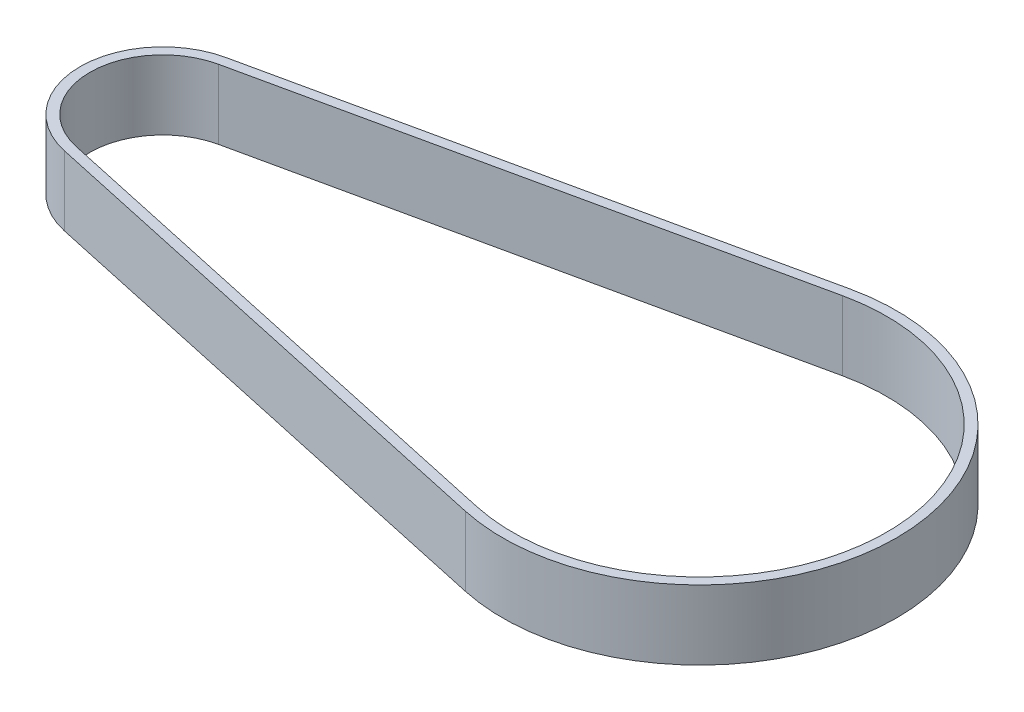
ISO-10303-21;
HEADER;
FILE_DESCRIPTION(('STEP AP214'),'2;1');
FILE_NAME('part.step','',(''),(''),'','','');
FILE_SCHEMA(('AUTOMOTIVE_DESIGN { 1 0 10303 214 1 1 1 1 }'));
ENDSEC;
DATA;
#1=APPLICATION_CONTEXT('core data for automotive mechanical design processes');
#2=APPLICATION_PROTOCOL_DEFINITION('international standard','automotive_design',2000,#1);
#3=PRODUCT_CONTEXT('',#1,'mechanical');
#4=PRODUCT('Part','Part','',(#3));
#5=PRODUCT_RELATED_PRODUCT_CATEGORY('part','',(#4));
#6=PRODUCT_DEFINITION_FORMATION('','',#4);
#7=PRODUCT_DEFINITION_CONTEXT('part definition',#1,'design');
#8=PRODUCT_DEFINITION('design','',#6,#7);
#9=PRODUCT_DEFINITION_SHAPE('','',#8);
#10=(LENGTH_UNIT() NAMED_UNIT(*) SI_UNIT(.MILLI.,.METRE.));
#11=(NAMED_UNIT(*) PLANE_ANGLE_UNIT() SI_UNIT($,.RADIAN.));
#12=(NAMED_UNIT(*) SI_UNIT($,.STERADIAN.) SOLID_ANGLE_UNIT());
#13=UNCERTAINTY_MEASURE_WITH_UNIT(LENGTH_MEASURE(1.E-05),#10,'distance_accuracy_value','');
#14=(GEOMETRIC_REPRESENTATION_CONTEXT(3) GLOBAL_UNCERTAINTY_ASSIGNED_CONTEXT((#13)) GLOBAL_UNIT_ASSIGNED_CONTEXT((#10,
#11,#12)) REPRESENTATION_CONTEXT('',''));
#15=CARTESIAN_POINT('',(0.,0.,0.));
#16=DIRECTION('',(0.,0.,1.));
#17=DIRECTION('',(1.,0.,0.));
#18=AXIS2_PLACEMENT_3D('',#15,#16,#17);
#19=CARTESIAN_POINT('',(-71.8766789781022,9.,10.473355567288));
#20=DIRECTION('',(0.212773722627737,0.,-0.977101500847857));
#21=DIRECTION('',(-0.977101500847857,0.,-0.212773722627737));
#22=AXIS2_PLACEMENT_3D('',#19,#20,#21);
#23=PLANE('',#22);
#24=DIRECTION('',(0.,-1.,0.));
#25=VECTOR('',#24,1.);
#26=CARTESIAN_POINT('',(-5.43147481751825,9.,24.9424700121432));
#27=LINE('',#26,#25);
#28=CARTESIAN_POINT('',(-5.43147481751825,9.,24.9424700121432));
#29=VERTEX_POINT('',#28);
#30=CARTESIAN_POINT('',(-5.43147481751825,0.,24.9424700121432));
#31=VERTEX_POINT('',#30);
#32=EDGE_CURVE('E92',#29,#31,#27,.T.);
#33=ORIENTED_EDGE('',*,*,#32,.F.);
#34=DIRECTION('',(0.977101500847857,0.,0.212773722627737));
#35=VECTOR('',#34,1.);
#36=CARTESIAN_POINT('',(-71.8766789781022,9.,10.473355567288));
#37=LINE('',#36,#35);
#38=CARTESIAN_POINT('',(-71.8766789781022,9.,10.473355567288));
#39=VERTEX_POINT('',#38);
#40=EDGE_CURVE('E91',#39,#29,#37,.T.);
#41=ORIENTED_EDGE('',*,*,#40,.F.);
#42=DIRECTION('',(0.,-1.,0.));
#43=VECTOR('',#42,1.);
#44=CARTESIAN_POINT('',(-71.8766789781022,9.,10.473355567288));
#45=LINE('',#44,#43);
#46=CARTESIAN_POINT('',(-71.8766789781022,0.,10.473355567288));
#47=VERTEX_POINT('',#46);
#48=EDGE_CURVE('E79',#47,#39,#45,.F.);
#49=ORIENTED_EDGE('',*,*,#48,.F.);
#50=DIRECTION('',(0.977101500847857,0.,0.212773722627737));
#51=VECTOR('',#50,1.);
#52=CARTESIAN_POINT('',(-71.8766789781022,0.,10.473355567288));
#53=LINE('',#52,#51);
#54=EDGE_CURVE('E107',#47,#31,#53,.T.);
#55=ORIENTED_EDGE('',*,*,#54,.T.);
#56=EDGE_LOOP('',(#33,#41,#49,#55));
#57=FACE_BOUND('',#56,.T.);
#58=ADVANCED_FACE('F17',(#57),#23,.F.);
#59=CARTESIAN_POINT('',(-69.596,9.,0.));
#60=DIRECTION('',(0.,-1.,0.));
#61=DIRECTION('',(0.,0.,-1.));
#62=AXIS2_PLACEMENT_3D('',#59,#60,#61);
#63=CYLINDRICAL_SURFACE('',#62,10.7188);
#64=CARTESIAN_POINT('',(-69.596,9.,0.));
#65=DIRECTION('',(0.,-1.,0.));
#66=DIRECTION('',(0.,0.,-1.));
#67=AXIS2_PLACEMENT_3D('',#64,#65,#66);
#68=CIRCLE('',#67,10.7188);
#69=CARTESIAN_POINT('',(-71.8766789781022,9.,-10.473355567288));
#70=VERTEX_POINT('',#69);
#71=EDGE_CURVE('E20',#70,#39,#68,.F.);
#72=ORIENTED_EDGE('',*,*,#71,.F.);
#73=DIRECTION('',(0.,1.,0.));
#74=VECTOR('',#73,1.);
#75=CARTESIAN_POINT('',(-71.8766789781022,9.,-10.473355567288));
#76=LINE('',#75,#74);
#77=CARTESIAN_POINT('',(-71.8766789781022,0.,-10.473355567288));
#78=VERTEX_POINT('',#77);
#79=EDGE_CURVE('E99',#70,#78,#76,.F.);
#80=ORIENTED_EDGE('',*,*,#79,.T.);
#81=CARTESIAN_POINT('',(-69.596,0.,0.));
#82=DIRECTION('',(0.,-1.,0.));
#83=DIRECTION('',(0.,0.,-1.));
#84=AXIS2_PLACEMENT_3D('',#81,#82,#83);
#85=CIRCLE('',#84,10.7188);
#86=EDGE_CURVE('E83',#78,#47,#85,.F.);
#87=ORIENTED_EDGE('',*,*,#86,.T.);
#88=ORIENTED_EDGE('',*,*,#48,.T.);
#89=EDGE_LOOP('',(#72,#80,#87,#88));
#90=FACE_BOUND('',#89,.T.);
#91=ADVANCED_FACE('F81',(#90),#63,.T.);
#92=CARTESIAN_POINT('',(-71.606456350365,9.,-9.23243666121123));
#93=DIRECTION('',(0.212773722627737,0.,0.977101500847857));
#94=DIRECTION('',(0.977101500847857,0.,-0.212773722627737));
#95=AXIS2_PLACEMENT_3D('',#92,#93,#94);
#96=PLANE('',#95);
#97=DIRECTION('',(0.977101500847857,0.,-0.212773722627737));
#98=VECTOR('',#97,1.);
#99=CARTESIAN_POINT('',(-71.606456350365,9.,-9.23243666121123));
#100=LINE('',#99,#98);
#101=CARTESIAN_POINT('',(-71.606456350365,9.,-9.23243666121123));
#102=VERTEX_POINT('',#101);
#103=CARTESIAN_POINT('',(-5.16125218978103,9.,-23.7015511060665));
#104=VERTEX_POINT('',#103);
#105=EDGE_CURVE('E122',#102,#104,#100,.T.);
#106=ORIENTED_EDGE('',*,*,#105,.F.);
#107=DIRECTION('',(0.,-1.,0.));
#108=VECTOR('',#107,1.);
#109=CARTESIAN_POINT('',(-71.606456350365,9.,-9.23243666121123));
#110=LINE('',#109,#108);
#111=CARTESIAN_POINT('',(-71.606456350365,0.,-9.23243666121123));
#112=VERTEX_POINT('',#111);
#113=EDGE_CURVE('E100',#102,#112,#110,.T.);
#114=ORIENTED_EDGE('',*,*,#113,.T.);
#115=DIRECTION('',(0.977101500847857,0.,-0.212773722627737));
#116=VECTOR('',#115,1.);
#117=CARTESIAN_POINT('',(-71.606456350365,0.,-9.23243666121123));
#118=LINE('',#117,#116);
#119=CARTESIAN_POINT('',(-5.16125218978103,0.,-23.7015511060665));
#120=VERTEX_POINT('',#119);
#121=EDGE_CURVE('E118',#112,#120,#118,.T.);
#122=ORIENTED_EDGE('',*,*,#121,.T.);
#123=DIRECTION('',(0.,-1.,0.));
#124=VECTOR('',#123,1.);
#125=CARTESIAN_POINT('',(-5.16125218978104,9.,-23.7015511060665));
#126=LINE('',#125,#124);
#127=EDGE_CURVE('E87',#120,#104,#126,.F.);
#128=ORIENTED_EDGE('',*,*,#127,.T.);
#129=EDGE_LOOP('',(#106,#114,#122,#128));
#130=FACE_BOUND('',#129,.T.);
#131=ADVANCED_FACE('F145',(#130),#96,.T.);
#132=CARTESIAN_POINT('',(0.,9.,0.));
#133=DIRECTION('',(0.,-1.,0.));
#134=DIRECTION('',(0.,0.,-1.));
#135=AXIS2_PLACEMENT_3D('',#132,#133,#134);
#136=CYLINDRICAL_SURFACE('',#135,24.257);
#137=CARTESIAN_POINT('',(0.,9.,0.));
#138=DIRECTION('',(0.,-1.,0.));
#139=DIRECTION('',(0.,0.,-1.));
#140=AXIS2_PLACEMENT_3D('',#137,#138,#139);
#141=CIRCLE('',#140,24.257);
#142=CARTESIAN_POINT('',(-5.16125218978103,9.,23.7015511060665));
#143=VERTEX_POINT('',#142);
#144=EDGE_CURVE('E108',#104,#143,#141,.T.);
#145=ORIENTED_EDGE('',*,*,#144,.F.);
#146=ORIENTED_EDGE('',*,*,#127,.F.);
#147=CARTESIAN_POINT('',(0.,0.,0.));
#148=DIRECTION('',(0.,-1.,0.));
#149=DIRECTION('',(0.,0.,-1.));
#150=AXIS2_PLACEMENT_3D('',#147,#148,#149);
#151=CIRCLE('',#150,24.257);
#152=CARTESIAN_POINT('',(-5.16125218978103,0.,23.7015511060665));
#153=VERTEX_POINT('',#152);
#154=EDGE_CURVE('E116',#120,#153,#151,.T.);
#155=ORIENTED_EDGE('',*,*,#154,.T.);
#156=DIRECTION('',(0.,1.,0.));
#157=VECTOR('',#156,1.);
#158=CARTESIAN_POINT('',(-5.16125218978103,9.,23.7015511060665));
#159=LINE('',#158,#157);
#160=EDGE_CURVE('E138',#143,#153,#159,.F.);
#161=ORIENTED_EDGE('',*,*,#160,.F.);
#162=EDGE_LOOP('',(#145,#146,#155,#161));
#163=FACE_BOUND('',#162,.T.);
#164=ADVANCED_FACE('F148',(#163),#136,.F.);
#165=CARTESIAN_POINT('',(-71.606456350365,9.,9.23243666121123));
#166=DIRECTION('',(0.212773722627737,0.,-0.977101500847857));
#167=DIRECTION('',(-0.977101500847857,0.,-0.212773722627737));
#168=AXIS2_PLACEMENT_3D('',#165,#166,#167);
#169=PLANE('',#168);
#170=DIRECTION('',(-0.977101500847857,0.,-0.212773722627737));
#171=VECTOR('',#170,1.);
#172=CARTESIAN_POINT('',(-5.16125218978103,9.,23.7015511060665));
#173=LINE('',#172,#171);
#174=CARTESIAN_POINT('',(-71.606456350365,9.,9.23243666121123));
#175=VERTEX_POINT('',#174);
#176=EDGE_CURVE('E125',#143,#175,#173,.T.);
#177=ORIENTED_EDGE('',*,*,#176,.F.);
#178=ORIENTED_EDGE('',*,*,#160,.T.);
#179=DIRECTION('',(-0.977101500847857,0.,-0.212773722627737));
#180=VECTOR('',#179,1.);
#181=CARTESIAN_POINT('',(-5.16125218978103,0.,23.7015511060665));
#182=LINE('',#181,#180);
#183=CARTESIAN_POINT('',(-71.606456350365,0.,9.23243666121123));
#184=VERTEX_POINT('',#183);
#185=EDGE_CURVE('E115',#153,#184,#182,.T.);
#186=ORIENTED_EDGE('',*,*,#185,.T.);
#187=DIRECTION('',(0.,-1.,0.));
#188=VECTOR('',#187,1.);
#189=CARTESIAN_POINT('',(-71.606456350365,9.,9.23243666121123));
#190=LINE('',#189,#188);
#191=EDGE_CURVE('E103',#184,#175,#190,.F.);
#192=ORIENTED_EDGE('',*,*,#191,.T.);
#193=EDGE_LOOP('',(#177,#178,#186,#192));
#194=FACE_BOUND('',#193,.T.);
#195=ADVANCED_FACE('F151',(#194),#169,.T.);
#196=CARTESIAN_POINT('',(-69.596,9.,0.));
#197=DIRECTION('',(0.,-1.,0.));
#198=DIRECTION('',(0.,0.,-1.));
#199=AXIS2_PLACEMENT_3D('',#196,#197,#198);
#200=CYLINDRICAL_SURFACE('',#199,9.4488);
#201=ORIENTED_EDGE('',*,*,#113,.F.);
#202=CARTESIAN_POINT('',(-69.596,9.,0.));
#203=DIRECTION('',(0.,-1.,0.));
#204=DIRECTION('',(0.,0.,-1.));
#205=AXIS2_PLACEMENT_3D('',#202,#203,#204);
#206=CIRCLE('',#205,9.4488);
#207=EDGE_CURVE('E123',#175,#102,#206,.T.);
#208=ORIENTED_EDGE('',*,*,#207,.F.);
#209=ORIENTED_EDGE('',*,*,#191,.F.);
#210=CARTESIAN_POINT('',(-69.596,0.,0.));
#211=DIRECTION('',(0.,-1.,0.));
#212=DIRECTION('',(0.,0.,-1.));
#213=AXIS2_PLACEMENT_3D('',#210,#211,#212);
#214=CIRCLE('',#213,9.4488);
#215=EDGE_CURVE('E112',#184,#112,#214,.T.);
#216=ORIENTED_EDGE('',*,*,#215,.T.);
#217=EDGE_LOOP('',(#201,#208,#209,#216));
#218=FACE_BOUND('',#217,.T.);
#219=ADVANCED_FACE('F155',(#218),#200,.F.);
#220=CARTESIAN_POINT('',(-71.8766789781022,9.,-10.473355567288));
#221=DIRECTION('',(0.212773722627737,0.,0.977101500847857));
#222=DIRECTION('',(0.977101500847857,0.,-0.212773722627737));
#223=AXIS2_PLACEMENT_3D('',#220,#221,#222);
#224=PLANE('',#223);
#225=ORIENTED_EDGE('',*,*,#79,.F.);
#226=DIRECTION('',(-0.977101500847857,0.,0.212773722627737));
#227=VECTOR('',#226,1.);
#228=CARTESIAN_POINT('',(-5.43147481751823,9.,-24.9424700121433));
#229=LINE('',#228,#227);
#230=CARTESIAN_POINT('',(-5.43147481751824,9.,-24.9424700121432));
#231=VERTEX_POINT('',#230);
#232=EDGE_CURVE('E94',#231,#70,#229,.T.);
#233=ORIENTED_EDGE('',*,*,#232,.F.);
#234=DIRECTION('',(0.,-1.,0.));
#235=VECTOR('',#234,1.);
#236=CARTESIAN_POINT('',(-5.43147481751824,9.,-24.9424700121433));
#237=LINE('',#236,#235);
#238=CARTESIAN_POINT('',(-5.43147481751824,0.,-24.9424700121432));
#239=VERTEX_POINT('',#238);
#240=EDGE_CURVE('E111',#239,#231,#237,.F.);
#241=ORIENTED_EDGE('',*,*,#240,.F.);
#242=DIRECTION('',(-0.977101500847857,0.,0.212773722627737));
#243=VECTOR('',#242,1.);
#244=CARTESIAN_POINT('',(-5.43147481751823,0.,-24.9424700121433));
#245=LINE('',#244,#243);
#246=EDGE_CURVE('E120',#239,#78,#245,.T.);
#247=ORIENTED_EDGE('',*,*,#246,.T.);
#248=EDGE_LOOP('',(#225,#233,#241,#247));
#249=FACE_BOUND('',#248,.T.);
#250=ADVANCED_FACE('F165',(#249),#224,.F.);
#251=CARTESIAN_POINT('',(-69.596,9.,0.));
#252=DIRECTION('',(0.,1.,0.));
#253=DIRECTION('',(0.,0.,1.));
#254=AXIS2_PLACEMENT_3D('',#251,#252,#253);
#255=PLANE('',#254);
#256=ORIENTED_EDGE('',*,*,#105,.T.);
#257=ORIENTED_EDGE('',*,*,#144,.T.);
#258=ORIENTED_EDGE('',*,*,#176,.T.);
#259=ORIENTED_EDGE('',*,*,#207,.T.);
#260=EDGE_LOOP('',(#256,#257,#258,#259));
#261=FACE_BOUND('',#260,.T.);
#262=CARTESIAN_POINT('',(0.,9.,0.));
#263=DIRECTION('',(0.,-1.,0.));
#264=DIRECTION('',(0.,0.,-1.));
#265=AXIS2_PLACEMENT_3D('',#262,#263,#264);
#266=CIRCLE('',#265,25.527);
#267=EDGE_CURVE('E26',#231,#29,#266,.T.);
#268=ORIENTED_EDGE('',*,*,#267,.F.);
#269=ORIENTED_EDGE('',*,*,#232,.T.);
#270=ORIENTED_EDGE('',*,*,#71,.T.);
#271=ORIENTED_EDGE('',*,*,#40,.T.);
#272=EDGE_LOOP('',(#268,#269,#270,#271));
#273=FACE_BOUND('',#272,.T.);
#274=ADVANCED_FACE('F97',(#261,#273),#255,.T.);
#275=CARTESIAN_POINT('',(-69.596,0.,0.));
#276=DIRECTION('',(0.,1.,0.));
#277=DIRECTION('',(0.,0.,1.));
#278=AXIS2_PLACEMENT_3D('',#275,#276,#277);
#279=PLANE('',#278);
#280=ORIENTED_EDGE('',*,*,#185,.F.);
#281=ORIENTED_EDGE('',*,*,#154,.F.);
#282=ORIENTED_EDGE('',*,*,#121,.F.);
#283=ORIENTED_EDGE('',*,*,#215,.F.);
#284=EDGE_LOOP('',(#280,#281,#282,#283));
#285=FACE_BOUND('',#284,.T.);
#286=ORIENTED_EDGE('',*,*,#246,.F.);
#287=CARTESIAN_POINT('',(0.,0.,0.));
#288=DIRECTION('',(0.,-1.,0.));
#289=DIRECTION('',(0.,0.,-1.));
#290=AXIS2_PLACEMENT_3D('',#287,#288,#289);
#291=CIRCLE('',#290,25.527);
#292=EDGE_CURVE('E11',#31,#239,#291,.F.);
#293=ORIENTED_EDGE('',*,*,#292,.F.);
#294=ORIENTED_EDGE('',*,*,#54,.F.);
#295=ORIENTED_EDGE('',*,*,#86,.F.);
#296=EDGE_LOOP('',(#286,#293,#294,#295));
#297=FACE_BOUND('',#296,.T.);
#298=ADVANCED_FACE('F157',(#285,#297),#279,.F.);
#299=CARTESIAN_POINT('',(0.,9.,0.));
#300=DIRECTION('',(0.,-1.,0.));
#301=DIRECTION('',(0.,0.,-1.));
#302=AXIS2_PLACEMENT_3D('',#299,#300,#301);
#303=CYLINDRICAL_SURFACE('',#302,25.527);
#304=ORIENTED_EDGE('',*,*,#292,.T.);
#305=ORIENTED_EDGE('',*,*,#240,.T.);
#306=ORIENTED_EDGE('',*,*,#267,.T.);
#307=ORIENTED_EDGE('',*,*,#32,.T.);
#308=EDGE_LOOP('',(#304,#305,#306,#307));
#309=FACE_BOUND('',#308,.T.);
#310=ADVANCED_FACE('F162',(#309),#303,.T.);
#311=CLOSED_SHELL('',(#58,#91,#131,#164,#195,#219,#250,#274,#298,#310));
#312=MANIFOLD_SOLID_BREP('B1',#311);
#313=ADVANCED_BREP_SHAPE_REPRESENTATION('',(#18,#312),#14);
#314=SHAPE_DEFINITION_REPRESENTATION(#9,#313);
ENDSEC;
END-ISO-10303-21;
